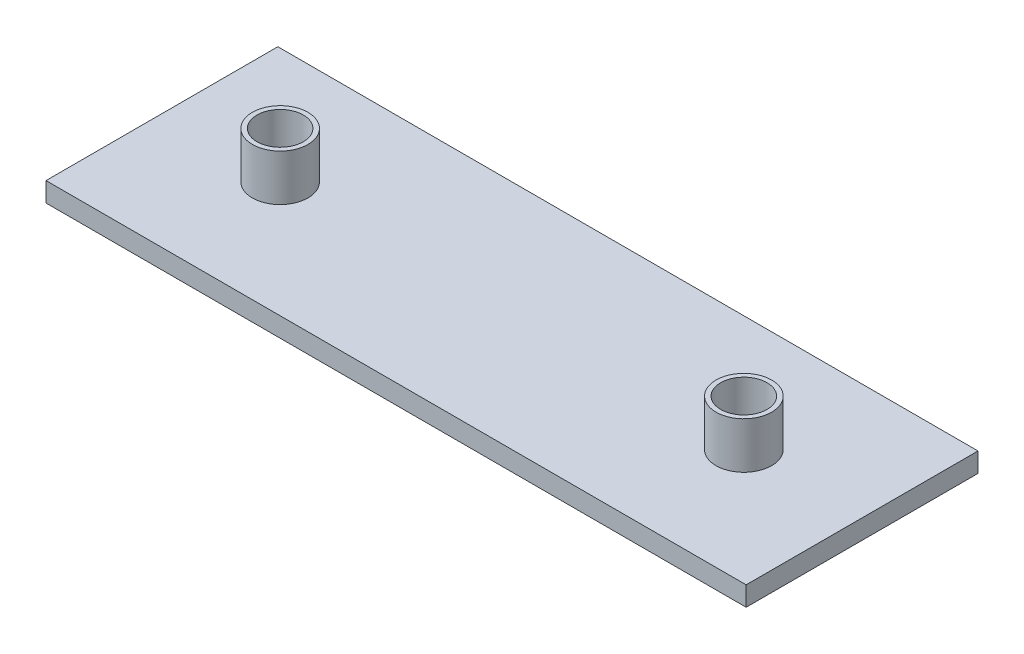
ISO-10303-21;
HEADER;
FILE_DESCRIPTION(('STEP AP214'),'2;1');
FILE_NAME('part.step','',(''),(''),'','','');
FILE_SCHEMA(('AUTOMOTIVE_DESIGN { 1 0 10303 214 1 1 1 1 }'));
ENDSEC;
DATA;
#1=APPLICATION_CONTEXT('core data for automotive mechanical design processes');
#2=APPLICATION_PROTOCOL_DEFINITION('international standard','automotive_design',2000,#1);
#3=PRODUCT_CONTEXT('',#1,'mechanical');
#4=PRODUCT('Part','Part','',(#3));
#5=PRODUCT_RELATED_PRODUCT_CATEGORY('part','',(#4));
#6=PRODUCT_DEFINITION_FORMATION('','',#4);
#7=PRODUCT_DEFINITION_CONTEXT('part definition',#1,'design');
#8=PRODUCT_DEFINITION('design','',#6,#7);
#9=PRODUCT_DEFINITION_SHAPE('','',#8);
#10=(LENGTH_UNIT() NAMED_UNIT(*) SI_UNIT(.MILLI.,.METRE.));
#11=(NAMED_UNIT(*) PLANE_ANGLE_UNIT() SI_UNIT($,.RADIAN.));
#12=(NAMED_UNIT(*) SI_UNIT($,.STERADIAN.) SOLID_ANGLE_UNIT());
#13=UNCERTAINTY_MEASURE_WITH_UNIT(LENGTH_MEASURE(1.E-05),#10,'distance_accuracy_value','');
#14=(GEOMETRIC_REPRESENTATION_CONTEXT(3) GLOBAL_UNCERTAINTY_ASSIGNED_CONTEXT((#13)) GLOBAL_UNIT_ASSIGNED_CONTEXT((#10,
#11,#12)) REPRESENTATION_CONTEXT('',''));
#15=CARTESIAN_POINT('',(0.,0.,0.));
#16=DIRECTION('',(0.,0.,1.));
#17=DIRECTION('',(1.,0.,0.));
#18=AXIS2_PLACEMENT_3D('',#15,#16,#17);
#19=CARTESIAN_POINT('',(-46.8463734668941,2.1,-20.5834877852149));
#20=DIRECTION('',(1.,0.,0.));
#21=DIRECTION('',(0.,0.,-1.));
#22=AXIS2_PLACEMENT_3D('',#19,#20,#21);
#23=PLANE('',#22);
#24=DIRECTION('',(0.,0.,1.));
#25=VECTOR('',#24,1.);
#26=CARTESIAN_POINT('',(-46.8463734668941,0.,-20.5834877852149));
#27=LINE('',#26,#25);
#28=CARTESIAN_POINT('',(-46.8463734668941,0.,-20.5834877852149));
#29=VERTEX_POINT('',#28);
#30=CARTESIAN_POINT('',(-46.8463734668941,0.,4.41651221478514));
#31=VERTEX_POINT('',#30);
#32=EDGE_CURVE('E151',#29,#31,#27,.T.);
#33=ORIENTED_EDGE('',*,*,#32,.T.);
#34=DIRECTION('',(0.,-1.,0.));
#35=VECTOR('',#34,1.);
#36=CARTESIAN_POINT('',(-46.8463734668941,2.1,4.41651221478514));
#37=LINE('',#36,#35);
#38=CARTESIAN_POINT('',(-46.8463734668941,2.1,4.41651221478514));
#39=VERTEX_POINT('',#38);
#40=EDGE_CURVE('E170',#39,#31,#37,.T.);
#41=ORIENTED_EDGE('',*,*,#40,.F.);
#42=DIRECTION('',(0.,0.,1.));
#43=VECTOR('',#42,1.);
#44=CARTESIAN_POINT('',(-46.8463734668941,2.1,-20.5834877852149));
#45=LINE('',#44,#43);
#46=CARTESIAN_POINT('',(-46.8463734668941,2.1,-20.5834877852149));
#47=VERTEX_POINT('',#46);
#48=EDGE_CURVE('E152',#47,#39,#45,.T.);
#49=ORIENTED_EDGE('',*,*,#48,.F.);
#50=DIRECTION('',(0.,-1.,0.));
#51=VECTOR('',#50,1.);
#52=CARTESIAN_POINT('',(-46.8463734668941,2.1,-20.5834877852149));
#53=LINE('',#52,#51);
#54=EDGE_CURVE('E158',#47,#29,#53,.T.);
#55=ORIENTED_EDGE('',*,*,#54,.T.);
#56=EDGE_LOOP('',(#33,#41,#49,#55));
#57=FACE_BOUND('',#56,.T.);
#58=ADVANCED_FACE('F36',(#57),#23,.F.);
#59=CARTESIAN_POINT('',(-46.8463734668941,2.1,4.41651221478514));
#60=DIRECTION('',(0.,0.,-1.));
#61=DIRECTION('',(-1.,0.,0.));
#62=AXIS2_PLACEMENT_3D('',#59,#60,#61);
#63=PLANE('',#62);
#64=DIRECTION('',(1.,0.,0.));
#65=VECTOR('',#64,1.);
#66=CARTESIAN_POINT('',(-46.8463734668941,0.,4.41651221478514));
#67=LINE('',#66,#65);
#68=CARTESIAN_POINT('',(28.6536265331059,0.,4.41651221478514));
#69=VERTEX_POINT('',#68);
#70=EDGE_CURVE('E161',#31,#69,#67,.T.);
#71=ORIENTED_EDGE('',*,*,#70,.T.);
#72=DIRECTION('',(0.,-1.,0.));
#73=VECTOR('',#72,1.);
#74=CARTESIAN_POINT('',(28.6536265331059,2.1,4.41651221478514));
#75=LINE('',#74,#73);
#76=CARTESIAN_POINT('',(28.6536265331059,2.1,4.41651221478514));
#77=VERTEX_POINT('',#76);
#78=EDGE_CURVE('E168',#77,#69,#75,.T.);
#79=ORIENTED_EDGE('',*,*,#78,.F.);
#80=DIRECTION('',(1.,0.,0.));
#81=VECTOR('',#80,1.);
#82=CARTESIAN_POINT('',(-46.8463734668941,2.1,4.41651221478514));
#83=LINE('',#82,#81);
#84=EDGE_CURVE('E84',#39,#77,#83,.T.);
#85=ORIENTED_EDGE('',*,*,#84,.F.);
#86=ORIENTED_EDGE('',*,*,#40,.T.);
#87=EDGE_LOOP('',(#71,#79,#85,#86));
#88=FACE_BOUND('',#87,.T.);
#89=ADVANCED_FACE('F202',(#88),#63,.F.);
#90=CARTESIAN_POINT('',(28.6536265331059,2.1,-20.5834877852149));
#91=DIRECTION('',(-1.,0.,0.));
#92=DIRECTION('',(0.,0.,1.));
#93=AXIS2_PLACEMENT_3D('',#90,#91,#92);
#94=PLANE('',#93);
#95=DIRECTION('',(0.,0.,-1.));
#96=VECTOR('',#95,1.);
#97=CARTESIAN_POINT('',(28.6536265331059,0.,-20.5834877852149));
#98=LINE('',#97,#96);
#99=CARTESIAN_POINT('',(28.6536265331059,0.,-20.5834877852149));
#100=VERTEX_POINT('',#99);
#101=EDGE_CURVE('E70',#69,#100,#98,.T.);
#102=ORIENTED_EDGE('',*,*,#101,.T.);
#103=DIRECTION('',(0.,-1.,0.));
#104=VECTOR('',#103,1.);
#105=CARTESIAN_POINT('',(28.6536265331059,2.1,-20.5834877852149));
#106=LINE('',#105,#104);
#107=CARTESIAN_POINT('',(28.6536265331059,2.1,-20.5834877852149));
#108=VERTEX_POINT('',#107);
#109=EDGE_CURVE('E166',#108,#100,#106,.T.);
#110=ORIENTED_EDGE('',*,*,#109,.F.);
#111=DIRECTION('',(0.,0.,-1.));
#112=VECTOR('',#111,1.);
#113=CARTESIAN_POINT('',(28.6536265331059,2.1,-20.5834877852149));
#114=LINE('',#113,#112);
#115=EDGE_CURVE('E155',#77,#108,#114,.T.);
#116=ORIENTED_EDGE('',*,*,#115,.F.);
#117=ORIENTED_EDGE('',*,*,#78,.T.);
#118=EDGE_LOOP('',(#102,#110,#116,#117));
#119=FACE_BOUND('',#118,.T.);
#120=ADVANCED_FACE('F207',(#119),#94,.F.);
#121=CARTESIAN_POINT('',(-46.8463734668941,2.1,-20.5834877852149));
#122=DIRECTION('',(0.,0.,1.));
#123=DIRECTION('',(1.,0.,0.));
#124=AXIS2_PLACEMENT_3D('',#121,#122,#123);
#125=PLANE('',#124);
#126=DIRECTION('',(-1.,0.,0.));
#127=VECTOR('',#126,1.);
#128=CARTESIAN_POINT('',(-46.8463734668941,0.,-20.5834877852149));
#129=LINE('',#128,#127);
#130=EDGE_CURVE('E76',#100,#29,#129,.T.);
#131=ORIENTED_EDGE('',*,*,#130,.T.);
#132=ORIENTED_EDGE('',*,*,#54,.F.);
#133=DIRECTION('',(-1.,0.,0.));
#134=VECTOR('',#133,1.);
#135=CARTESIAN_POINT('',(-46.8463734668941,2.1,-20.5834877852149));
#136=LINE('',#135,#134);
#137=EDGE_CURVE('E52',#108,#47,#136,.T.);
#138=ORIENTED_EDGE('',*,*,#137,.F.);
#139=ORIENTED_EDGE('',*,*,#109,.T.);
#140=EDGE_LOOP('',(#131,#132,#138,#139));
#141=FACE_BOUND('',#140,.T.);
#142=ADVANCED_FACE('F199',(#141),#125,.F.);
#143=CARTESIAN_POINT('',(0.,2.1,0.));
#144=DIRECTION('',(0.,1.,0.));
#145=DIRECTION('',(0.,0.,1.));
#146=AXIS2_PLACEMENT_3D('',#143,#144,#145);
#147=PLANE('',#146);
#148=CARTESIAN_POINT('',(15.9036265331059,2.1,-8.08348778521486));
#149=DIRECTION('',(0.,1.,0.));
#150=DIRECTION('',(0.,0.,1.));
#151=AXIS2_PLACEMENT_3D('',#148,#149,#150);
#152=CIRCLE('',#151,3.);
#153=CARTESIAN_POINT('',(15.9036265331059,2.1,-5.08348778521486));
#154=VERTEX_POINT('',#153);
#155=EDGE_CURVE('E267',#154,#154,#152,.T.);
#156=ORIENTED_EDGE('',*,*,#155,.F.);
#157=EDGE_LOOP('',(#156));
#158=FACE_BOUND('',#157,.T.);
#159=CARTESIAN_POINT('',(-34.0963734668941,2.1,-8.08348778521488));
#160=DIRECTION('',(0.,1.,0.));
#161=DIRECTION('',(0.,0.,1.));
#162=AXIS2_PLACEMENT_3D('',#159,#160,#161);
#163=CIRCLE('',#162,3.);
#164=CARTESIAN_POINT('',(-34.0963734668941,2.1,-5.08348778521488));
#165=VERTEX_POINT('',#164);
#166=EDGE_CURVE('E281',#165,#165,#163,.T.);
#167=ORIENTED_EDGE('',*,*,#166,.F.);
#168=EDGE_LOOP('',(#167));
#169=FACE_BOUND('',#168,.T.);
#170=ORIENTED_EDGE('',*,*,#48,.T.);
#171=ORIENTED_EDGE('',*,*,#84,.T.);
#172=ORIENTED_EDGE('',*,*,#115,.T.);
#173=ORIENTED_EDGE('',*,*,#137,.T.);
#174=EDGE_LOOP('',(#170,#171,#172,#173));
#175=FACE_BOUND('',#174,.T.);
#176=ADVANCED_FACE('F183',(#158,#169,#175),#147,.T.);
#177=CARTESIAN_POINT('',(0.,0.,0.));
#178=DIRECTION('',(0.,1.,0.));
#179=DIRECTION('',(0.,0.,1.));
#180=AXIS2_PLACEMENT_3D('',#177,#178,#179);
#181=PLANE('',#180);
#182=ORIENTED_EDGE('',*,*,#32,.F.);
#183=ORIENTED_EDGE('',*,*,#130,.F.);
#184=ORIENTED_EDGE('',*,*,#101,.F.);
#185=ORIENTED_EDGE('',*,*,#70,.F.);
#186=EDGE_LOOP('',(#182,#183,#184,#185));
#187=FACE_BOUND('',#186,.T.);
#188=ADVANCED_FACE('F198',(#187),#181,.F.);
#189=CARTESIAN_POINT('',(-34.0963734668941,7.1,-8.08348778521488));
#190=DIRECTION('',(0.,1.,0.));
#191=DIRECTION('',(0.,0.,1.));
#192=AXIS2_PLACEMENT_3D('',#189,#190,#191);
#193=PLANE('',#192);
#194=CARTESIAN_POINT('',(-34.0963734668941,7.1,-8.08348778521488));
#195=DIRECTION('',(0.,1.,0.));
#196=DIRECTION('',(0.,0.,1.));
#197=AXIS2_PLACEMENT_3D('',#194,#195,#196);
#198=CIRCLE('',#197,3.);
#199=CARTESIAN_POINT('',(-34.0963734668941,7.1,-5.08348778521488));
#200=VERTEX_POINT('',#199);
#201=EDGE_CURVE('E138',#200,#200,#198,.T.);
#202=ORIENTED_EDGE('',*,*,#201,.T.);
#203=EDGE_LOOP('',(#202));
#204=FACE_BOUND('',#203,.T.);
#205=CARTESIAN_POINT('',(-34.0963734668941,7.1,-8.08348778521488));
#206=DIRECTION('',(0.,1.,0.));
#207=DIRECTION('',(0.,0.,1.));
#208=AXIS2_PLACEMENT_3D('',#205,#206,#207);
#209=CIRCLE('',#208,2.5);
#210=CARTESIAN_POINT('',(-34.0963734668941,7.1,-5.58348778521487));
#211=VERTEX_POINT('',#210);
#212=EDGE_CURVE('E276',#211,#211,#209,.T.);
#213=ORIENTED_EDGE('',*,*,#212,.F.);
#214=EDGE_LOOP('',(#213));
#215=FACE_BOUND('',#214,.T.);
#216=ADVANCED_FACE('F220',(#204,#215),#193,.T.);
#217=CARTESIAN_POINT('',(-34.0963734668941,7.1,-8.08348778521488));
#218=DIRECTION('',(0.,-1.,0.));
#219=DIRECTION('',(0.,0.,-1.));
#220=AXIS2_PLACEMENT_3D('',#217,#218,#219);
#221=CYLINDRICAL_SURFACE('',#220,3.);
#222=ORIENTED_EDGE('',*,*,#201,.F.);
#223=EDGE_LOOP('',(#222));
#224=FACE_BOUND('',#223,.T.);
#225=ORIENTED_EDGE('',*,*,#166,.T.);
#226=EDGE_LOOP('',(#225));
#227=FACE_BOUND('',#226,.T.);
#228=ADVANCED_FACE('F224',(#224,#227),#221,.T.);
#229=CARTESIAN_POINT('',(-34.0963734668941,7.1,-8.08348778521488));
#230=DIRECTION('',(0.,-1.,0.));
#231=DIRECTION('',(0.,0.,-1.));
#232=AXIS2_PLACEMENT_3D('',#229,#230,#231);
#233=CYLINDRICAL_SURFACE('',#232,2.5);
#234=ORIENTED_EDGE('',*,*,#212,.T.);
#235=EDGE_LOOP('',(#234));
#236=FACE_BOUND('',#235,.T.);
#237=CARTESIAN_POINT('',(-34.0963734668941,2.1,-8.08348778521488));
#238=DIRECTION('',(0.,1.,0.));
#239=DIRECTION('',(0.,0.,1.));
#240=AXIS2_PLACEMENT_3D('',#237,#238,#239);
#241=CIRCLE('',#240,2.5);
#242=CARTESIAN_POINT('',(-34.0963734668941,2.1,-5.58348778521487));
#243=VERTEX_POINT('',#242);
#244=EDGE_CURVE('E172',#243,#243,#241,.F.);
#245=ORIENTED_EDGE('',*,*,#244,.T.);
#246=EDGE_LOOP('',(#245));
#247=FACE_BOUND('',#246,.T.);
#248=ADVANCED_FACE('F195',(#236,#247),#233,.F.);
#249=ORIENTED_EDGE('',*,*,#244,.F.);
#250=EDGE_LOOP('',(#249));
#251=FACE_BOUND('',#250,.T.);
#252=ADVANCED_FACE('F182',(#251),#147,.T.);
#253=CARTESIAN_POINT('',(15.9036265331059,7.1,-8.08348778521486));
#254=DIRECTION('',(0.,1.,0.));
#255=DIRECTION('',(0.,0.,1.));
#256=AXIS2_PLACEMENT_3D('',#253,#254,#255);
#257=PLANE('',#256);
#258=CARTESIAN_POINT('',(15.9036265331059,7.1,-8.08348778521486));
#259=DIRECTION('',(0.,1.,0.));
#260=DIRECTION('',(0.,0.,1.));
#261=AXIS2_PLACEMENT_3D('',#258,#259,#260);
#262=CIRCLE('',#261,3.);
#263=CARTESIAN_POINT('',(15.9036265331059,7.1,-5.08348778521486));
#264=VERTEX_POINT('',#263);
#265=EDGE_CURVE('E273',#264,#264,#262,.T.);
#266=ORIENTED_EDGE('',*,*,#265,.T.);
#267=EDGE_LOOP('',(#266));
#268=FACE_BOUND('',#267,.T.);
#269=CARTESIAN_POINT('',(15.9036265331059,7.1,-8.08348778521486));
#270=DIRECTION('',(0.,1.,0.));
#271=DIRECTION('',(0.,0.,1.));
#272=AXIS2_PLACEMENT_3D('',#269,#270,#271);
#273=CIRCLE('',#272,2.5);
#274=CARTESIAN_POINT('',(15.9036265331059,7.1,-5.58348778521486));
#275=VERTEX_POINT('',#274);
#276=EDGE_CURVE('E263',#275,#275,#273,.T.);
#277=ORIENTED_EDGE('',*,*,#276,.F.);
#278=EDGE_LOOP('',(#277));
#279=FACE_BOUND('',#278,.T.);
#280=ADVANCED_FACE('F194',(#268,#279),#257,.T.);
#281=CARTESIAN_POINT('',(15.9036265331059,7.1,-8.08348778521486));
#282=DIRECTION('',(0.,-1.,0.));
#283=DIRECTION('',(0.,0.,-1.));
#284=AXIS2_PLACEMENT_3D('',#281,#282,#283);
#285=CYLINDRICAL_SURFACE('',#284,3.);
#286=ORIENTED_EDGE('',*,*,#265,.F.);
#287=EDGE_LOOP('',(#286));
#288=FACE_BOUND('',#287,.T.);
#289=ORIENTED_EDGE('',*,*,#155,.T.);
#290=EDGE_LOOP('',(#289));
#291=FACE_BOUND('',#290,.T.);
#292=ADVANCED_FACE('F188',(#288,#291),#285,.T.);
#293=CARTESIAN_POINT('',(15.9036265331059,7.1,-8.08348778521486));
#294=DIRECTION('',(0.,-1.,0.));
#295=DIRECTION('',(0.,0.,-1.));
#296=AXIS2_PLACEMENT_3D('',#293,#294,#295);
#297=CYLINDRICAL_SURFACE('',#296,2.5);
#298=ORIENTED_EDGE('',*,*,#276,.T.);
#299=EDGE_LOOP('',(#298));
#300=FACE_BOUND('',#299,.T.);
#301=CARTESIAN_POINT('',(15.9036265331059,2.1,-8.08348778521486));
#302=DIRECTION('',(0.,1.,0.));
#303=DIRECTION('',(0.,0.,1.));
#304=AXIS2_PLACEMENT_3D('',#301,#302,#303);
#305=CIRCLE('',#304,2.5);
#306=CARTESIAN_POINT('',(15.9036265331059,2.1,-5.58348778521486));
#307=VERTEX_POINT('',#306);
#308=EDGE_CURVE('E44',#307,#307,#305,.F.);
#309=ORIENTED_EDGE('',*,*,#308,.T.);
#310=EDGE_LOOP('',(#309));
#311=FACE_BOUND('',#310,.T.);
#312=ADVANCED_FACE('F177',(#300,#311),#297,.F.);
#313=ORIENTED_EDGE('',*,*,#308,.F.);
#314=EDGE_LOOP('',(#313));
#315=FACE_BOUND('',#314,.T.);
#316=ADVANCED_FACE('F179',(#315),#147,.T.);
#317=CLOSED_SHELL('',(#58,#89,#120,#142,#176,#188,#216,#228,#248,#252,#280,#292,#312,#316));
#318=CARTESIAN_POINT('',(-34.0963734668941,0.849999999999993,-8.08348778521488));
#319=DIRECTION('',(0.,1.,0.));
#320=DIRECTION('',(-1.,0.,0.));
#321=AXIS2_PLACEMENT_3D('',#318,#319,#320);
#322=CYLINDRICAL_SURFACE('',#321,2.5);
#323=DIRECTION('',(0.,1.,0.));
#324=VECTOR('',#323,1.);
#325=CARTESIAN_POINT('',(-34.0963734668941,0.849999999999993,-5.58348778521487));
#326=LINE('',#325,#324);
#327=CARTESIAN_POINT('',(-34.0963734668941,0.849999999999993,-5.58348778521487));
#328=VERTEX_POINT('',#327);
#329=CARTESIAN_POINT('',(-34.0963734668941,1.24999999999999,-5.58348778521487));
#330=VERTEX_POINT('',#329);
#331=EDGE_CURVE('E128',#328,#330,#326,.T.);
#332=ORIENTED_EDGE('',*,*,#331,.F.);
#333=CARTESIAN_POINT('',(-34.0963734668941,0.849999999999993,-8.08348778521488));
#334=DIRECTION('',(0.,-1.,0.));
#335=DIRECTION('',(1.,0.,0.));
#336=AXIS2_PLACEMENT_3D('',#333,#334,#335);
#337=CIRCLE('',#336,2.5);
#338=CARTESIAN_POINT('',(-34.0963734668941,0.849999999999993,-10.5834877852149));
#339=VERTEX_POINT('',#338);
#340=EDGE_CURVE('E133',#328,#339,#337,.T.);
#341=ORIENTED_EDGE('',*,*,#340,.T.);
#342=DIRECTION('',(0.,1.,0.));
#343=VECTOR('',#342,1.);
#344=CARTESIAN_POINT('',(-34.0963734668941,0.849999999999993,-10.5834877852149));
#345=LINE('',#344,#343);
#346=CARTESIAN_POINT('',(-34.0963734668941,1.25,-10.5834877852149));
#347=VERTEX_POINT('',#346);
#348=EDGE_CURVE('E148',#339,#347,#345,.T.);
#349=ORIENTED_EDGE('',*,*,#348,.T.);
#350=CARTESIAN_POINT('',(-34.0963734668941,1.25,-8.08348778521488));
#351=DIRECTION('',(0.,-1.,0.));
#352=DIRECTION('',(0.,0.,-1.));
#353=AXIS2_PLACEMENT_3D('',#350,#351,#352);
#354=CIRCLE('',#353,2.5);
#355=EDGE_CURVE('E264',#347,#330,#354,.T.);
#356=ORIENTED_EDGE('',*,*,#355,.T.);
#357=EDGE_LOOP('',(#332,#341,#349,#356));
#358=FACE_BOUND('',#357,.T.);
#359=CARTESIAN_POINT('',(-34.0963734668941,1.75,-8.08348778521488));
#360=DIRECTION('',(0.,-1.,0.));
#361=DIRECTION('',(0.,0.,-1.));
#362=AXIS2_PLACEMENT_3D('',#359,#360,#361);
#363=CIRCLE('',#362,2.5);
#364=CARTESIAN_POINT('',(-34.0963734668941,1.75,-10.5834877852149));
#365=VERTEX_POINT('',#364);
#366=EDGE_CURVE('E261',#365,#365,#363,.T.);
#367=ORIENTED_EDGE('',*,*,#366,.F.);
#368=EDGE_LOOP('',(#367));
#369=FACE_BOUND('',#368,.T.);
#370=ADVANCED_FACE('F251',(#358,#369),#322,.F.);
#371=CARTESIAN_POINT('',(-34.0963734668941,0.849999999999993,-10.5834877852149));
#372=DIRECTION('',(0.,0.,1.));
#373=DIRECTION('',(1.,0.,0.));
#374=AXIS2_PLACEMENT_3D('',#371,#372,#373);
#375=PLANE('',#374);
#376=ORIENTED_EDGE('',*,*,#348,.F.);
#377=DIRECTION('',(1.,0.,0.));
#378=VECTOR('',#377,1.);
#379=CARTESIAN_POINT('',(-34.0963734668941,0.849999999999993,-10.5834877852149));
#380=LINE('',#379,#378);
#381=CARTESIAN_POINT('',(15.9036265331059,0.849999999999999,-10.5834877852149));
#382=VERTEX_POINT('',#381);
#383=EDGE_CURVE('E136',#339,#382,#380,.T.);
#384=ORIENTED_EDGE('',*,*,#383,.T.);
#385=DIRECTION('',(0.,1.,0.));
#386=VECTOR('',#385,1.);
#387=CARTESIAN_POINT('',(15.9036265331059,0.849999999999999,-10.5834877852149));
#388=LINE('',#387,#386);
#389=CARTESIAN_POINT('',(15.9036265331059,1.25,-10.5834877852149));
#390=VERTEX_POINT('',#389);
#391=EDGE_CURVE('E127',#382,#390,#388,.T.);
#392=ORIENTED_EDGE('',*,*,#391,.T.);
#393=DIRECTION('',(1.,0.,0.));
#394=VECTOR('',#393,1.);
#395=CARTESIAN_POINT('',(-34.0963734668941,1.24999999999999,-10.5834877852149));
#396=LINE('',#395,#394);
#397=EDGE_CURVE('E115',#347,#390,#396,.T.);
#398=ORIENTED_EDGE('',*,*,#397,.F.);
#399=EDGE_LOOP('',(#376,#384,#392,#398));
#400=FACE_BOUND('',#399,.T.);
#401=ADVANCED_FACE('F249',(#400),#375,.T.);
#402=CARTESIAN_POINT('',(15.9036265331059,0.849999999999999,-8.08348778521486));
#403=DIRECTION('',(0.,1.,0.));
#404=DIRECTION('',(-1.,0.,0.));
#405=AXIS2_PLACEMENT_3D('',#402,#403,#404);
#406=CYLINDRICAL_SURFACE('',#405,2.5);
#407=ORIENTED_EDGE('',*,*,#391,.F.);
#408=CARTESIAN_POINT('',(15.9036265331059,0.849999999999999,-8.08348778521486));
#409=DIRECTION('',(0.,-1.,0.));
#410=DIRECTION('',(1.,0.,0.));
#411=AXIS2_PLACEMENT_3D('',#408,#409,#410);
#412=CIRCLE('',#411,2.5);
#413=CARTESIAN_POINT('',(15.9036265331059,0.849999999999999,-5.58348778521486));
#414=VERTEX_POINT('',#413);
#415=EDGE_CURVE('E124',#382,#414,#412,.T.);
#416=ORIENTED_EDGE('',*,*,#415,.T.);
#417=DIRECTION('',(0.,1.,0.));
#418=VECTOR('',#417,1.);
#419=CARTESIAN_POINT('',(15.9036265331059,0.849999999999999,-5.58348778521486));
#420=LINE('',#419,#418);
#421=CARTESIAN_POINT('',(15.9036265331059,1.25,-5.58348778521486));
#422=VERTEX_POINT('',#421);
#423=EDGE_CURVE('E120',#414,#422,#420,.T.);
#424=ORIENTED_EDGE('',*,*,#423,.T.);
#425=CARTESIAN_POINT('',(15.9036265331059,1.25,-8.08348778521486));
#426=DIRECTION('',(0.,-1.,0.));
#427=DIRECTION('',(1.,0.,0.));
#428=AXIS2_PLACEMENT_3D('',#425,#426,#427);
#429=CIRCLE('',#428,2.5);
#430=EDGE_CURVE('E11',#422,#390,#429,.T.);
#431=ORIENTED_EDGE('',*,*,#430,.T.);
#432=EDGE_LOOP('',(#407,#416,#424,#431));
#433=FACE_BOUND('',#432,.T.);
#434=CARTESIAN_POINT('',(15.9036265331059,1.75,-8.08348778521486));
#435=DIRECTION('',(0.,-1.,0.));
#436=DIRECTION('',(0.,0.,-1.));
#437=AXIS2_PLACEMENT_3D('',#434,#435,#436);
#438=CIRCLE('',#437,2.5);
#439=CARTESIAN_POINT('',(15.9036265331059,1.75,-10.5834877852149));
#440=VERTEX_POINT('',#439);
#441=EDGE_CURVE('E269',#440,#440,#438,.T.);
#442=ORIENTED_EDGE('',*,*,#441,.F.);
#443=EDGE_LOOP('',(#442));
#444=FACE_BOUND('',#443,.T.);
#445=ADVANCED_FACE('F121',(#433,#444),#406,.F.);
#446=CARTESIAN_POINT('',(-34.0963734668941,0.849999999999993,-5.58348778521487));
#447=DIRECTION('',(0.,0.,-1.));
#448=DIRECTION('',(-1.,0.,0.));
#449=AXIS2_PLACEMENT_3D('',#446,#447,#448);
#450=PLANE('',#449);
#451=ORIENTED_EDGE('',*,*,#423,.F.);
#452=DIRECTION('',(-1.,0.,0.));
#453=VECTOR('',#452,1.);
#454=CARTESIAN_POINT('',(-34.0963734668941,0.849999999999993,-5.58348778521487));
#455=LINE('',#454,#453);
#456=EDGE_CURVE('E144',#414,#328,#455,.T.);
#457=ORIENTED_EDGE('',*,*,#456,.T.);
#458=ORIENTED_EDGE('',*,*,#331,.T.);
#459=DIRECTION('',(-1.,0.,0.));
#460=VECTOR('',#459,1.);
#461=CARTESIAN_POINT('',(-34.0963734668941,1.24999999999999,-5.58348778521487));
#462=LINE('',#461,#460);
#463=EDGE_CURVE('E113',#422,#330,#462,.T.);
#464=ORIENTED_EDGE('',*,*,#463,.F.);
#465=EDGE_LOOP('',(#451,#457,#458,#464));
#466=FACE_BOUND('',#465,.T.);
#467=ADVANCED_FACE('F131',(#466),#450,.T.);
#468=CARTESIAN_POINT('',(-34.0963734668941,0.849999999999993,-8.08348778521488));
#469=DIRECTION('',(0.,-1.,0.));
#470=DIRECTION('',(1.,0.,0.));
#471=AXIS2_PLACEMENT_3D('',#468,#469,#470);
#472=PLANE('',#471);
#473=ORIENTED_EDGE('',*,*,#340,.F.);
#474=ORIENTED_EDGE('',*,*,#456,.F.);
#475=ORIENTED_EDGE('',*,*,#415,.F.);
#476=ORIENTED_EDGE('',*,*,#383,.F.);
#477=EDGE_LOOP('',(#473,#474,#475,#476));
#478=FACE_BOUND('',#477,.T.);
#479=ADVANCED_FACE('F240',(#478),#472,.F.);
#480=CARTESIAN_POINT('',(-34.0963734668941,1.24999999999999,-8.08348778521488));
#481=DIRECTION('',(0.,-1.,0.));
#482=DIRECTION('',(1.,0.,0.));
#483=AXIS2_PLACEMENT_3D('',#480,#481,#482);
#484=PLANE('',#483);
#485=ORIENTED_EDGE('',*,*,#430,.F.);
#486=ORIENTED_EDGE('',*,*,#463,.T.);
#487=ORIENTED_EDGE('',*,*,#355,.F.);
#488=ORIENTED_EDGE('',*,*,#397,.T.);
#489=EDGE_LOOP('',(#485,#486,#487,#488));
#490=FACE_BOUND('',#489,.T.);
#491=ADVANCED_FACE('F111',(#490),#484,.T.);
#492=CARTESIAN_POINT('',(-34.0963734668941,1.75,-8.08348778521488));
#493=DIRECTION('',(0.,-1.,0.));
#494=DIRECTION('',(0.,0.,-1.));
#495=AXIS2_PLACEMENT_3D('',#492,#493,#494);
#496=PLANE('',#495);
#497=ORIENTED_EDGE('',*,*,#366,.T.);
#498=EDGE_LOOP('',(#497));
#499=FACE_BOUND('',#498,.T.);
#500=ADVANCED_FACE('F239',(#499),#496,.T.);
#501=CARTESIAN_POINT('',(15.9036265331059,1.75,-8.08348778521486));
#502=DIRECTION('',(0.,-1.,0.));
#503=DIRECTION('',(0.,0.,-1.));
#504=AXIS2_PLACEMENT_3D('',#501,#502,#503);
#505=PLANE('',#504);
#506=ORIENTED_EDGE('',*,*,#441,.T.);
#507=EDGE_LOOP('',(#506));
#508=FACE_BOUND('',#507,.T.);
#509=ADVANCED_FACE('F362',(#508),#505,.T.);
#510=CLOSED_SHELL('',(#370,#401,#445,#467,#479,#491,#500,#509));
#511=ORIENTED_CLOSED_SHELL('',*,#510,.T.);
#512=BREP_WITH_VOIDS('B2',#317,(#511));
#513=ADVANCED_BREP_SHAPE_REPRESENTATION('',(#18,#512),#14);
#514=SHAPE_DEFINITION_REPRESENTATION(#9,#513);
ENDSEC;
END-ISO-10303-21;
